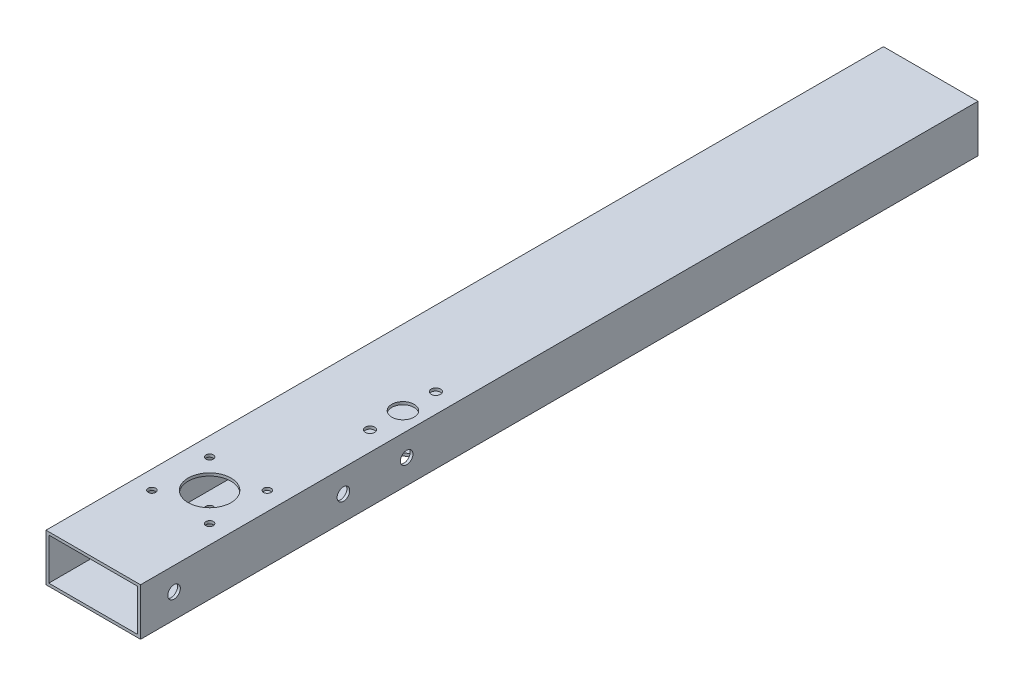
ISO-10303-21;
HEADER;
FILE_DESCRIPTION(('STEP AP214'),'2;1');
FILE_NAME('part.step','',(''),(''),'','','');
FILE_SCHEMA(('AUTOMOTIVE_DESIGN { 1 0 10303 214 1 1 1 1 }'));
ENDSEC;
DATA;
#1=APPLICATION_CONTEXT('core data for automotive mechanical design processes');
#2=APPLICATION_PROTOCOL_DEFINITION('international standard','automotive_design',2000,#1);
#3=PRODUCT_CONTEXT('',#1,'mechanical');
#4=PRODUCT('Part','Part','',(#3));
#5=PRODUCT_RELATED_PRODUCT_CATEGORY('part','',(#4));
#6=PRODUCT_DEFINITION_FORMATION('','',#4);
#7=PRODUCT_DEFINITION_CONTEXT('part definition',#1,'design');
#8=PRODUCT_DEFINITION('design','',#6,#7);
#9=PRODUCT_DEFINITION_SHAPE('','',#8);
#10=(LENGTH_UNIT() NAMED_UNIT(*) SI_UNIT(.MILLI.,.METRE.));
#11=(NAMED_UNIT(*) PLANE_ANGLE_UNIT() SI_UNIT($,.RADIAN.));
#12=(NAMED_UNIT(*) SI_UNIT($,.STERADIAN.) SOLID_ANGLE_UNIT());
#13=UNCERTAINTY_MEASURE_WITH_UNIT(LENGTH_MEASURE(1.E-05),#10,'distance_accuracy_value','');
#14=(GEOMETRIC_REPRESENTATION_CONTEXT(3) GLOBAL_UNCERTAINTY_ASSIGNED_CONTEXT((#13)) GLOBAL_UNIT_ASSIGNED_CONTEXT((#10,
#11,#12)) REPRESENTATION_CONTEXT('',''));
#15=CARTESIAN_POINT('',(0.,0.,0.));
#16=DIRECTION('',(0.,0.,1.));
#17=DIRECTION('',(1.,0.,0.));
#18=AXIS2_PLACEMENT_3D('',#15,#16,#17);
#19=CARTESIAN_POINT('',(-25.4000000000001,-12.7,450.));
#20=DIRECTION('',(1.,0.,0.));
#21=DIRECTION('',(0.,0.,-1.));
#22=AXIS2_PLACEMENT_3D('',#19,#20,#21);
#23=PLANE('',#22);
#24=CARTESIAN_POINT('',(-25.4000000000001,0.400000000001483,432.));
#25=DIRECTION('',(-1.,0.,0.));
#26=DIRECTION('',(0.,0.,1.));
#27=AXIS2_PLACEMENT_3D('',#24,#25,#26);
#28=CIRCLE('',#27,3.37819999999999);
#29=CARTESIAN_POINT('',(-25.4000000000001,0.400000000001483,435.3782));
#30=VERTEX_POINT('',#29);
#31=EDGE_CURVE('E235',#30,#30,#28,.T.);
#32=ORIENTED_EDGE('',*,*,#31,.F.);
#33=EDGE_LOOP('',(#32));
#34=FACE_BOUND('',#33,.T.);
#35=CARTESIAN_POINT('',(-25.4000000000001,0.399999999999345,307.000000000001));
#36=DIRECTION('',(-1.,0.,0.));
#37=DIRECTION('',(0.,0.,1.));
#38=AXIS2_PLACEMENT_3D('',#35,#36,#37);
#39=CIRCLE('',#38,3.37819999999999);
#40=CARTESIAN_POINT('',(-25.4000000000001,0.399999999999345,310.378200000001));
#41=VERTEX_POINT('',#40);
#42=EDGE_CURVE('E242',#41,#41,#39,.T.);
#43=ORIENTED_EDGE('',*,*,#42,.F.);
#44=EDGE_LOOP('',(#43));
#45=FACE_BOUND('',#44,.T.);
#46=DIRECTION('',(0.,-1.,0.));
#47=VECTOR('',#46,1.);
#48=CARTESIAN_POINT('',(-25.4000000000004,-12.7,0.));
#49=LINE('',#48,#47);
#50=CARTESIAN_POINT('',(-25.4000000000001,12.7,0.));
#51=VERTEX_POINT('',#50);
#52=CARTESIAN_POINT('',(-25.4000000000004,-12.7,0.));
#53=VERTEX_POINT('',#52);
#54=EDGE_CURVE('E157',#51,#53,#49,.T.);
#55=ORIENTED_EDGE('',*,*,#54,.T.);
#56=DIRECTION('',(0.,0.,-1.));
#57=VECTOR('',#56,1.);
#58=CARTESIAN_POINT('',(-25.4000000000001,-12.7,450.));
#59=LINE('',#58,#57);
#60=CARTESIAN_POINT('',(-25.4000000000001,-12.7,450.));
#61=VERTEX_POINT('',#60);
#62=EDGE_CURVE('E162',#61,#53,#59,.T.);
#63=ORIENTED_EDGE('',*,*,#62,.F.);
#64=DIRECTION('',(0.,-1.,0.));
#65=VECTOR('',#64,1.);
#66=CARTESIAN_POINT('',(-25.4000000000001,-12.7,450.));
#67=LINE('',#66,#65);
#68=CARTESIAN_POINT('',(-25.4,12.7,450.));
#69=VERTEX_POINT('',#68);
#70=EDGE_CURVE('E148',#69,#61,#67,.T.);
#71=ORIENTED_EDGE('',*,*,#70,.F.);
#72=DIRECTION('',(0.,0.,-1.));
#73=VECTOR('',#72,1.);
#74=CARTESIAN_POINT('',(-25.4,12.7,450.));
#75=LINE('',#74,#73);
#76=EDGE_CURVE('E45',#69,#51,#75,.T.);
#77=ORIENTED_EDGE('',*,*,#76,.T.);
#78=EDGE_LOOP('',(#55,#63,#71,#77));
#79=FACE_BOUND('',#78,.T.);
#80=CARTESIAN_POINT('',(-25.4000000000001,0.399999999997569,340.999999999999));
#81=DIRECTION('',(-1.,0.,0.));
#82=DIRECTION('',(0.,0.,1.));
#83=AXIS2_PLACEMENT_3D('',#80,#81,#82);
#84=CIRCLE('',#83,3.37819999999999);
#85=CARTESIAN_POINT('',(-25.4000000000001,0.399999999997569,344.378199999999));
#86=VERTEX_POINT('',#85);
#87=EDGE_CURVE('E228',#86,#86,#84,.T.);
#88=ORIENTED_EDGE('',*,*,#87,.F.);
#89=EDGE_LOOP('',(#88));
#90=FACE_BOUND('',#89,.T.);
#91=ADVANCED_FACE('F36',(#34,#45,#79,#90),#23,.F.);
#92=CARTESIAN_POINT('',(0.,0.,450.));
#93=DIRECTION('',(0.,0.,-1.));
#94=DIRECTION('',(-1.,0.,0.));
#95=AXIS2_PLACEMENT_3D('',#92,#93,#94);
#96=PLANE('',#95);
#97=DIRECTION('',(0.,1.,0.));
#98=VECTOR('',#97,1.);
#99=CARTESIAN_POINT('',(25.4,-12.7,450.));
#100=LINE('',#99,#98);
#101=CARTESIAN_POINT('',(25.4,-12.7,450.));
#102=VERTEX_POINT('',#101);
#103=CARTESIAN_POINT('',(25.4,12.7,450.));
#104=VERTEX_POINT('',#103);
#105=EDGE_CURVE('E142',#102,#104,#100,.T.);
#106=ORIENTED_EDGE('',*,*,#105,.T.);
#107=DIRECTION('',(-1.,0.,0.));
#108=VECTOR('',#107,1.);
#109=CARTESIAN_POINT('',(-25.4,12.7,450.));
#110=LINE('',#109,#108);
#111=EDGE_CURVE('E145',#104,#69,#110,.T.);
#112=ORIENTED_EDGE('',*,*,#111,.T.);
#113=ORIENTED_EDGE('',*,*,#70,.T.);
#114=DIRECTION('',(1.,0.,0.));
#115=VECTOR('',#114,1.);
#116=CARTESIAN_POINT('',(-25.4000000000001,-12.7,450.));
#117=LINE('',#116,#115);
#118=EDGE_CURVE('E150',#61,#102,#117,.T.);
#119=ORIENTED_EDGE('',*,*,#118,.T.);
#120=EDGE_LOOP('',(#106,#112,#113,#119));
#121=FACE_BOUND('',#120,.T.);
#122=DIRECTION('',(1.,0.,0.));
#123=VECTOR('',#122,1.);
#124=CARTESIAN_POINT('',(-23.9000000000001,-11.2,450.));
#125=LINE('',#124,#123);
#126=CARTESIAN_POINT('',(-23.9000000000001,-11.2,450.));
#127=VERTEX_POINT('',#126);
#128=CARTESIAN_POINT('',(23.8999999999999,-11.2,450.));
#129=VERTEX_POINT('',#128);
#130=EDGE_CURVE('E103',#127,#129,#125,.T.);
#131=ORIENTED_EDGE('',*,*,#130,.F.);
#132=DIRECTION('',(0.,-1.,0.));
#133=VECTOR('',#132,1.);
#134=CARTESIAN_POINT('',(-23.9000000000001,-11.2,450.));
#135=LINE('',#134,#133);
#136=CARTESIAN_POINT('',(-23.9,11.2,450.));
#137=VERTEX_POINT('',#136);
#138=EDGE_CURVE('E126',#137,#127,#135,.T.);
#139=ORIENTED_EDGE('',*,*,#138,.F.);
#140=DIRECTION('',(-1.,0.,0.));
#141=VECTOR('',#140,1.);
#142=CARTESIAN_POINT('',(-23.9,11.2,450.));
#143=LINE('',#142,#141);
#144=CARTESIAN_POINT('',(23.9,11.2,450.));
#145=VERTEX_POINT('',#144);
#146=EDGE_CURVE('E124',#145,#137,#143,.T.);
#147=ORIENTED_EDGE('',*,*,#146,.F.);
#148=DIRECTION('',(0.,1.,0.));
#149=VECTOR('',#148,1.);
#150=CARTESIAN_POINT('',(23.8999999999999,-11.2,450.));
#151=LINE('',#150,#149);
#152=EDGE_CURVE('E111',#129,#145,#151,.T.);
#153=ORIENTED_EDGE('',*,*,#152,.F.);
#154=EDGE_LOOP('',(#131,#139,#147,#153));
#155=FACE_BOUND('',#154,.T.);
#156=ADVANCED_FACE('F123',(#121,#155),#96,.F.);
#157=CARTESIAN_POINT('',(0.,0.,0.));
#158=DIRECTION('',(0.,0.,-1.));
#159=DIRECTION('',(-1.,0.,0.));
#160=AXIS2_PLACEMENT_3D('',#157,#158,#159);
#161=PLANE('',#160);
#162=DIRECTION('',(0.,1.,0.));
#163=VECTOR('',#162,1.);
#164=CARTESIAN_POINT('',(25.3999999999996,-12.7,0.));
#165=LINE('',#164,#163);
#166=CARTESIAN_POINT('',(25.3999999999996,-12.7,0.));
#167=VERTEX_POINT('',#166);
#168=CARTESIAN_POINT('',(25.4,12.7,0.));
#169=VERTEX_POINT('',#168);
#170=EDGE_CURVE('E119',#167,#169,#165,.T.);
#171=ORIENTED_EDGE('',*,*,#170,.F.);
#172=DIRECTION('',(1.,0.,0.));
#173=VECTOR('',#172,1.);
#174=CARTESIAN_POINT('',(-25.4000000000004,-12.7,0.));
#175=LINE('',#174,#173);
#176=EDGE_CURVE('E146',#53,#167,#175,.T.);
#177=ORIENTED_EDGE('',*,*,#176,.F.);
#178=ORIENTED_EDGE('',*,*,#54,.F.);
#179=DIRECTION('',(-1.,0.,0.));
#180=VECTOR('',#179,1.);
#181=CARTESIAN_POINT('',(-25.4000000000001,12.7,0.));
#182=LINE('',#181,#180);
#183=EDGE_CURVE('E155',#169,#51,#182,.T.);
#184=ORIENTED_EDGE('',*,*,#183,.F.);
#185=EDGE_LOOP('',(#171,#177,#178,#184));
#186=FACE_BOUND('',#185,.T.);
#187=DIRECTION('',(0.,-1.,0.));
#188=VECTOR('',#187,1.);
#189=CARTESIAN_POINT('',(-23.9000000000004,-11.2,0.));
#190=LINE('',#189,#188);
#191=CARTESIAN_POINT('',(-23.9,11.2,0.));
#192=VERTEX_POINT('',#191);
#193=CARTESIAN_POINT('',(-23.9000000000004,-11.2,0.));
#194=VERTEX_POINT('',#193);
#195=EDGE_CURVE('E112',#192,#194,#190,.T.);
#196=ORIENTED_EDGE('',*,*,#195,.T.);
#197=DIRECTION('',(1.,0.,0.));
#198=VECTOR('',#197,1.);
#199=CARTESIAN_POINT('',(-23.9000000000004,-11.2,0.));
#200=LINE('',#199,#198);
#201=CARTESIAN_POINT('',(23.8999999999996,-11.2,0.));
#202=VERTEX_POINT('',#201);
#203=EDGE_CURVE('E61',#194,#202,#200,.T.);
#204=ORIENTED_EDGE('',*,*,#203,.T.);
#205=DIRECTION('',(0.,1.,0.));
#206=VECTOR('',#205,1.);
#207=CARTESIAN_POINT('',(23.8999999999996,-11.2,0.));
#208=LINE('',#207,#206);
#209=CARTESIAN_POINT('',(23.8999999999999,11.2,0.));
#210=VERTEX_POINT('',#209);
#211=EDGE_CURVE('E118',#202,#210,#208,.T.);
#212=ORIENTED_EDGE('',*,*,#211,.T.);
#213=DIRECTION('',(-1.,0.,0.));
#214=VECTOR('',#213,1.);
#215=CARTESIAN_POINT('',(-23.9,11.2,0.));
#216=LINE('',#215,#214);
#217=EDGE_CURVE('E134',#210,#192,#216,.T.);
#218=ORIENTED_EDGE('',*,*,#217,.T.);
#219=EDGE_LOOP('',(#196,#204,#212,#218));
#220=FACE_BOUND('',#219,.T.);
#221=ADVANCED_FACE('F308',(#186,#220),#161,.T.);
#222=CARTESIAN_POINT('',(25.4,-12.7,450.));
#223=DIRECTION('',(-1.,0.,0.));
#224=DIRECTION('',(0.,0.,1.));
#225=AXIS2_PLACEMENT_3D('',#222,#223,#224);
#226=PLANE('',#225);
#227=CARTESIAN_POINT('',(25.4,0.399999999997569,340.999999999998));
#228=DIRECTION('',(-1.,0.,0.));
#229=DIRECTION('',(0.,0.,1.));
#230=AXIS2_PLACEMENT_3D('',#227,#228,#229);
#231=CIRCLE('',#230,3.37819999999998);
#232=CARTESIAN_POINT('',(25.4,0.399999999997569,344.378199999998));
#233=VERTEX_POINT('',#232);
#234=EDGE_CURVE('E206',#233,#233,#231,.T.);
#235=ORIENTED_EDGE('',*,*,#234,.T.);
#236=EDGE_LOOP('',(#235));
#237=FACE_BOUND('',#236,.T.);
#238=CARTESIAN_POINT('',(25.4,0.400000000001483,431.999999999999));
#239=DIRECTION('',(-1.,0.,0.));
#240=DIRECTION('',(0.,0.,1.));
#241=AXIS2_PLACEMENT_3D('',#238,#239,#240);
#242=CIRCLE('',#241,3.37819999999998);
#243=CARTESIAN_POINT('',(25.4,0.400000000001483,435.378199999999));
#244=VERTEX_POINT('',#243);
#245=EDGE_CURVE('E201',#244,#244,#242,.T.);
#246=ORIENTED_EDGE('',*,*,#245,.T.);
#247=EDGE_LOOP('',(#246));
#248=FACE_BOUND('',#247,.T.);
#249=CARTESIAN_POINT('',(25.4,0.399999999999345,307.000000000001));
#250=DIRECTION('',(-1.,0.,0.));
#251=DIRECTION('',(0.,0.,1.));
#252=AXIS2_PLACEMENT_3D('',#249,#250,#251);
#253=CIRCLE('',#252,3.37819999999998);
#254=CARTESIAN_POINT('',(25.4,0.399999999999345,310.378200000001));
#255=VERTEX_POINT('',#254);
#256=EDGE_CURVE('E196',#255,#255,#253,.T.);
#257=ORIENTED_EDGE('',*,*,#256,.T.);
#258=EDGE_LOOP('',(#257));
#259=FACE_BOUND('',#258,.T.);
#260=ORIENTED_EDGE('',*,*,#170,.T.);
#261=DIRECTION('',(0.,0.,-1.));
#262=VECTOR('',#261,1.);
#263=CARTESIAN_POINT('',(25.4,12.7,450.));
#264=LINE('',#263,#262);
#265=EDGE_CURVE('E11',#104,#169,#264,.T.);
#266=ORIENTED_EDGE('',*,*,#265,.F.);
#267=ORIENTED_EDGE('',*,*,#105,.F.);
#268=DIRECTION('',(0.,0.,-1.));
#269=VECTOR('',#268,1.);
#270=CARTESIAN_POINT('',(25.4,-12.7,450.));
#271=LINE('',#270,#269);
#272=EDGE_CURVE('E152',#102,#167,#271,.T.);
#273=ORIENTED_EDGE('',*,*,#272,.T.);
#274=EDGE_LOOP('',(#260,#266,#267,#273));
#275=FACE_BOUND('',#274,.T.);
#276=ADVANCED_FACE('F38',(#237,#248,#259,#275),#226,.F.);
#277=CARTESIAN_POINT('',(-25.4,12.7,450.));
#278=DIRECTION('',(0.,-1.,0.));
#279=DIRECTION('',(0.,0.,-1.));
#280=AXIS2_PLACEMENT_3D('',#277,#278,#279);
#281=PLANE('',#280);
#282=CARTESIAN_POINT('',(14.8999999999996,12.7,280.8));
#283=DIRECTION('',(0.,-1.,0.));
#284=DIRECTION('',(0.,0.,-1.));
#285=AXIS2_PLACEMENT_3D('',#282,#283,#284);
#286=CIRCLE('',#285,2.5);
#287=CARTESIAN_POINT('',(14.8999999999996,12.7,278.3));
#288=VERTEX_POINT('',#287);
#289=EDGE_CURVE('E327',#288,#288,#286,.F.);
#290=ORIENTED_EDGE('',*,*,#289,.F.);
#291=EDGE_LOOP('',(#290));
#292=FACE_BOUND('',#291,.T.);
#293=CARTESIAN_POINT('',(14.8999999999999,12.7,316.2));
#294=DIRECTION('',(0.,-1.,0.));
#295=DIRECTION('',(0.,0.,-1.));
#296=AXIS2_PLACEMENT_3D('',#293,#294,#295);
#297=CIRCLE('',#296,2.5);
#298=CARTESIAN_POINT('',(14.8999999999999,12.7,313.7));
#299=VERTEX_POINT('',#298);
#300=EDGE_CURVE('E331',#299,#299,#297,.F.);
#301=ORIENTED_EDGE('',*,*,#300,.F.);
#302=EDGE_LOOP('',(#301));
#303=FACE_BOUND('',#302,.T.);
#304=CARTESIAN_POINT('',(14.9,12.7,298.5));
#305=DIRECTION('',(0.,-1.,0.));
#306=DIRECTION('',(0.,0.,-1.));
#307=AXIS2_PLACEMENT_3D('',#304,#305,#306);
#308=CIRCLE('',#307,6.00000000000001);
#309=CARTESIAN_POINT('',(14.9,12.7,292.5));
#310=VERTEX_POINT('',#309);
#311=EDGE_CURVE('E210',#310,#310,#308,.F.);
#312=ORIENTED_EDGE('',*,*,#311,.F.);
#313=EDGE_LOOP('',(#312));
#314=FACE_BOUND('',#313,.T.);
#315=CARTESIAN_POINT('',(-15.5000000000004,12.7,372.));
#316=DIRECTION('',(0.,-1.,0.));
#317=DIRECTION('',(0.,0.,-1.));
#318=AXIS2_PLACEMENT_3D('',#315,#316,#317);
#319=CIRCLE('',#318,2.);
#320=CARTESIAN_POINT('',(-15.5000000000004,12.7,370.));
#321=VERTEX_POINT('',#320);
#322=EDGE_CURVE('E253',#321,#321,#319,.T.);
#323=ORIENTED_EDGE('',*,*,#322,.T.);
#324=EDGE_LOOP('',(#323));
#325=FACE_BOUND('',#324,.T.);
#326=CARTESIAN_POINT('',(15.4999999999996,12.7,372.));
#327=DIRECTION('',(0.,-1.,0.));
#328=DIRECTION('',(0.,0.,-1.));
#329=AXIS2_PLACEMENT_3D('',#326,#327,#328);
#330=CIRCLE('',#329,2.);
#331=CARTESIAN_POINT('',(15.4999999999996,12.7,370.));
#332=VERTEX_POINT('',#331);
#333=EDGE_CURVE('E260',#332,#332,#330,.T.);
#334=ORIENTED_EDGE('',*,*,#333,.T.);
#335=EDGE_LOOP('',(#334));
#336=FACE_BOUND('',#335,.T.);
#337=CARTESIAN_POINT('',(15.5,12.7,403.));
#338=DIRECTION('',(0.,-1.,0.));
#339=DIRECTION('',(0.,0.,-1.));
#340=AXIS2_PLACEMENT_3D('',#337,#338,#339);
#341=CIRCLE('',#340,2.);
#342=CARTESIAN_POINT('',(15.5,12.7,401.));
#343=VERTEX_POINT('',#342);
#344=EDGE_CURVE('E267',#343,#343,#341,.T.);
#345=ORIENTED_EDGE('',*,*,#344,.T.);
#346=EDGE_LOOP('',(#345));
#347=FACE_BOUND('',#346,.T.);
#348=CARTESIAN_POINT('',(-15.5000000000001,12.7,403.));
#349=DIRECTION('',(0.,-1.,0.));
#350=DIRECTION('',(0.,0.,-1.));
#351=AXIS2_PLACEMENT_3D('',#348,#349,#350);
#352=CIRCLE('',#351,2.);
#353=CARTESIAN_POINT('',(-15.5000000000001,12.7,401.));
#354=VERTEX_POINT('',#353);
#355=EDGE_CURVE('E274',#354,#354,#352,.T.);
#356=ORIENTED_EDGE('',*,*,#355,.T.);
#357=EDGE_LOOP('',(#356));
#358=FACE_BOUND('',#357,.T.);
#359=CARTESIAN_POINT('',(0.,12.7,387.5));
#360=DIRECTION('',(0.,-1.,0.));
#361=DIRECTION('',(0.,0.,-1.));
#362=AXIS2_PLACEMENT_3D('',#359,#360,#361);
#363=CIRCLE('',#362,11.5);
#364=CARTESIAN_POINT('',(0.,12.7,376.));
#365=VERTEX_POINT('',#364);
#366=EDGE_CURVE('E132',#365,#365,#363,.T.);
#367=ORIENTED_EDGE('',*,*,#366,.T.);
#368=EDGE_LOOP('',(#367));
#369=FACE_BOUND('',#368,.T.);
#370=ORIENTED_EDGE('',*,*,#183,.T.);
#371=ORIENTED_EDGE('',*,*,#76,.F.);
#372=ORIENTED_EDGE('',*,*,#111,.F.);
#373=ORIENTED_EDGE('',*,*,#265,.T.);
#374=EDGE_LOOP('',(#370,#371,#372,#373));
#375=FACE_BOUND('',#374,.T.);
#376=ADVANCED_FACE('F283',(#292,#303,#314,#325,#336,#347,#358,#369,#375),#281,.F.);
#377=CARTESIAN_POINT('',(-25.4000000000001,-12.7,450.));
#378=DIRECTION('',(0.,1.,0.));
#379=DIRECTION('',(0.,0.,1.));
#380=AXIS2_PLACEMENT_3D('',#377,#378,#379);
#381=PLANE('',#380);
#382=CARTESIAN_POINT('',(14.8999999999999,-12.7,280.8));
#383=DIRECTION('',(0.,-1.,0.));
#384=DIRECTION('',(0.,0.,-1.));
#385=AXIS2_PLACEMENT_3D('',#382,#383,#384);
#386=CIRCLE('',#385,2.5);
#387=CARTESIAN_POINT('',(14.8999999999999,-12.7,278.3));
#388=VERTEX_POINT('',#387);
#389=EDGE_CURVE('E413',#388,#388,#386,.T.);
#390=ORIENTED_EDGE('',*,*,#389,.F.);
#391=EDGE_LOOP('',(#390));
#392=FACE_BOUND('',#391,.T.);
#393=CARTESIAN_POINT('',(14.8999999999996,-12.7,316.2));
#394=DIRECTION('',(0.,-1.,0.));
#395=DIRECTION('',(0.,0.,-1.));
#396=AXIS2_PLACEMENT_3D('',#393,#394,#395);
#397=CIRCLE('',#396,2.5);
#398=CARTESIAN_POINT('',(14.8999999999996,-12.7,313.7));
#399=VERTEX_POINT('',#398);
#400=EDGE_CURVE('E408',#399,#399,#397,.T.);
#401=ORIENTED_EDGE('',*,*,#400,.F.);
#402=EDGE_LOOP('',(#401));
#403=FACE_BOUND('',#402,.T.);
#404=CARTESIAN_POINT('',(14.9,-12.7,298.5));
#405=DIRECTION('',(0.,-1.,0.));
#406=DIRECTION('',(0.,0.,-1.));
#407=AXIS2_PLACEMENT_3D('',#404,#405,#406);
#408=CIRCLE('',#407,6.00000000000001);
#409=CARTESIAN_POINT('',(14.9,-12.7,292.5));
#410=VERTEX_POINT('',#409);
#411=EDGE_CURVE('E411',#410,#410,#408,.T.);
#412=ORIENTED_EDGE('',*,*,#411,.F.);
#413=EDGE_LOOP('',(#412));
#414=FACE_BOUND('',#413,.T.);
#415=CARTESIAN_POINT('',(-15.5,-12.7,372.));
#416=DIRECTION('',(0.,-1.,0.));
#417=DIRECTION('',(0.,0.,1.));
#418=AXIS2_PLACEMENT_3D('',#415,#416,#417);
#419=CIRCLE('',#418,2.);
#420=CARTESIAN_POINT('',(-15.5,-12.7,374.));
#421=VERTEX_POINT('',#420);
#422=EDGE_CURVE('E191',#421,#421,#419,.T.);
#423=ORIENTED_EDGE('',*,*,#422,.F.);
#424=EDGE_LOOP('',(#423));
#425=FACE_BOUND('',#424,.T.);
#426=CARTESIAN_POINT('',(15.5,-12.7,372.));
#427=DIRECTION('',(0.,-1.,0.));
#428=DIRECTION('',(0.,0.,-1.));
#429=AXIS2_PLACEMENT_3D('',#426,#427,#428);
#430=CIRCLE('',#429,2.);
#431=CARTESIAN_POINT('',(15.5,-12.7,370.));
#432=VERTEX_POINT('',#431);
#433=EDGE_CURVE('E186',#432,#432,#430,.T.);
#434=ORIENTED_EDGE('',*,*,#433,.F.);
#435=EDGE_LOOP('',(#434));
#436=FACE_BOUND('',#435,.T.);
#437=CARTESIAN_POINT('',(15.5,-12.7,403.));
#438=DIRECTION('',(0.,-1.,0.));
#439=DIRECTION('',(0.,0.,1.));
#440=AXIS2_PLACEMENT_3D('',#437,#438,#439);
#441=CIRCLE('',#440,2.);
#442=CARTESIAN_POINT('',(15.5,-12.7,405.));
#443=VERTEX_POINT('',#442);
#444=EDGE_CURVE('E181',#443,#443,#441,.T.);
#445=ORIENTED_EDGE('',*,*,#444,.F.);
#446=EDGE_LOOP('',(#445));
#447=FACE_BOUND('',#446,.T.);
#448=CARTESIAN_POINT('',(-15.5,-12.7,403.));
#449=DIRECTION('',(0.,-1.,0.));
#450=DIRECTION('',(0.,0.,-1.));
#451=AXIS2_PLACEMENT_3D('',#448,#449,#450);
#452=CIRCLE('',#451,2.);
#453=CARTESIAN_POINT('',(-15.5,-12.7,401.));
#454=VERTEX_POINT('',#453);
#455=EDGE_CURVE('E176',#454,#454,#452,.T.);
#456=ORIENTED_EDGE('',*,*,#455,.F.);
#457=EDGE_LOOP('',(#456));
#458=FACE_BOUND('',#457,.T.);
#459=CARTESIAN_POINT('',(0.,-12.7,387.5));
#460=DIRECTION('',(0.,-1.,0.));
#461=DIRECTION('',(0.,0.,-1.));
#462=AXIS2_PLACEMENT_3D('',#459,#460,#461);
#463=CIRCLE('',#462,11.5);
#464=CARTESIAN_POINT('',(0.,-12.7,376.));
#465=VERTEX_POINT('',#464);
#466=EDGE_CURVE('E171',#465,#465,#463,.T.);
#467=ORIENTED_EDGE('',*,*,#466,.F.);
#468=EDGE_LOOP('',(#467));
#469=FACE_BOUND('',#468,.T.);
#470=ORIENTED_EDGE('',*,*,#176,.T.);
#471=ORIENTED_EDGE('',*,*,#272,.F.);
#472=ORIENTED_EDGE('',*,*,#118,.F.);
#473=ORIENTED_EDGE('',*,*,#62,.T.);
#474=EDGE_LOOP('',(#470,#471,#472,#473));
#475=FACE_BOUND('',#474,.T.);
#476=ADVANCED_FACE('F314',(#392,#403,#414,#425,#436,#447,#458,#469,#475),#381,.F.);
#477=CARTESIAN_POINT('',(-23.9000000000001,-11.2,450.));
#478=DIRECTION('',(0.,1.,0.));
#479=DIRECTION('',(0.,0.,1.));
#480=AXIS2_PLACEMENT_3D('',#477,#478,#479);
#481=PLANE('',#480);
#482=CARTESIAN_POINT('',(14.8999999999999,-11.2,280.8));
#483=DIRECTION('',(0.,1.,0.));
#484=DIRECTION('',(0.,0.,1.));
#485=AXIS2_PLACEMENT_3D('',#482,#483,#484);
#486=CIRCLE('',#485,2.5);
#487=CARTESIAN_POINT('',(14.8999999999999,-11.2,283.3));
#488=VERTEX_POINT('',#487);
#489=EDGE_CURVE('E225',#488,#488,#486,.T.);
#490=ORIENTED_EDGE('',*,*,#489,.F.);
#491=EDGE_LOOP('',(#490));
#492=FACE_BOUND('',#491,.T.);
#493=CARTESIAN_POINT('',(14.8999999999996,-11.2,316.2));
#494=DIRECTION('',(0.,1.,0.));
#495=DIRECTION('',(0.,0.,1.));
#496=AXIS2_PLACEMENT_3D('',#493,#494,#495);
#497=CIRCLE('',#496,2.5);
#498=CARTESIAN_POINT('',(14.8999999999996,-11.2,318.7));
#499=VERTEX_POINT('',#498);
#500=EDGE_CURVE('E213',#499,#499,#497,.T.);
#501=ORIENTED_EDGE('',*,*,#500,.F.);
#502=EDGE_LOOP('',(#501));
#503=FACE_BOUND('',#502,.T.);
#504=CARTESIAN_POINT('',(14.9,-11.2,298.5));
#505=DIRECTION('',(0.,1.,0.));
#506=DIRECTION('',(0.,0.,1.));
#507=AXIS2_PLACEMENT_3D('',#504,#505,#506);
#508=CIRCLE('',#507,6.00000000000001);
#509=CARTESIAN_POINT('',(14.9,-11.2,304.5));
#510=VERTEX_POINT('',#509);
#511=EDGE_CURVE('E209',#510,#510,#508,.T.);
#512=ORIENTED_EDGE('',*,*,#511,.F.);
#513=EDGE_LOOP('',(#512));
#514=FACE_BOUND('',#513,.T.);
#515=CARTESIAN_POINT('',(-15.5,-11.2,372.));
#516=DIRECTION('',(0.,1.,0.));
#517=DIRECTION('',(0.,0.,1.));
#518=AXIS2_PLACEMENT_3D('',#515,#516,#517);
#519=CIRCLE('',#518,2.);
#520=CARTESIAN_POINT('',(-15.5,-11.2,374.));
#521=VERTEX_POINT('',#520);
#522=EDGE_CURVE('E190',#521,#521,#519,.T.);
#523=ORIENTED_EDGE('',*,*,#522,.F.);
#524=EDGE_LOOP('',(#523));
#525=FACE_BOUND('',#524,.T.);
#526=CARTESIAN_POINT('',(15.5,-11.2,372.));
#527=DIRECTION('',(0.,1.,0.));
#528=DIRECTION('',(0.,0.,1.));
#529=AXIS2_PLACEMENT_3D('',#526,#527,#528);
#530=CIRCLE('',#529,2.);
#531=CARTESIAN_POINT('',(15.5,-11.2,374.));
#532=VERTEX_POINT('',#531);
#533=EDGE_CURVE('E185',#532,#532,#530,.T.);
#534=ORIENTED_EDGE('',*,*,#533,.F.);
#535=EDGE_LOOP('',(#534));
#536=FACE_BOUND('',#535,.T.);
#537=CARTESIAN_POINT('',(15.5,-11.2,403.));
#538=DIRECTION('',(0.,1.,0.));
#539=DIRECTION('',(0.,0.,1.));
#540=AXIS2_PLACEMENT_3D('',#537,#538,#539);
#541=CIRCLE('',#540,2.);
#542=CARTESIAN_POINT('',(15.5,-11.2,405.));
#543=VERTEX_POINT('',#542);
#544=EDGE_CURVE('E180',#543,#543,#541,.T.);
#545=ORIENTED_EDGE('',*,*,#544,.F.);
#546=EDGE_LOOP('',(#545));
#547=FACE_BOUND('',#546,.T.);
#548=CARTESIAN_POINT('',(-15.5,-11.2,403.));
#549=DIRECTION('',(0.,1.,0.));
#550=DIRECTION('',(0.,0.,1.));
#551=AXIS2_PLACEMENT_3D('',#548,#549,#550);
#552=CIRCLE('',#551,2.);
#553=CARTESIAN_POINT('',(-15.5,-11.2,405.));
#554=VERTEX_POINT('',#553);
#555=EDGE_CURVE('E175',#554,#554,#552,.T.);
#556=ORIENTED_EDGE('',*,*,#555,.F.);
#557=EDGE_LOOP('',(#556));
#558=FACE_BOUND('',#557,.T.);
#559=CARTESIAN_POINT('',(0.,-11.2,387.5));
#560=DIRECTION('',(0.,1.,0.));
#561=DIRECTION('',(0.,0.,1.));
#562=AXIS2_PLACEMENT_3D('',#559,#560,#561);
#563=CIRCLE('',#562,11.5);
#564=CARTESIAN_POINT('',(0.,-11.2,399.));
#565=VERTEX_POINT('',#564);
#566=EDGE_CURVE('E170',#565,#565,#563,.T.);
#567=ORIENTED_EDGE('',*,*,#566,.F.);
#568=EDGE_LOOP('',(#567));
#569=FACE_BOUND('',#568,.T.);
#570=ORIENTED_EDGE('',*,*,#203,.F.);
#571=DIRECTION('',(0.,0.,-1.));
#572=VECTOR('',#571,1.);
#573=CARTESIAN_POINT('',(-23.9000000000001,-11.2,450.));
#574=LINE('',#573,#572);
#575=EDGE_CURVE('E107',#127,#194,#574,.T.);
#576=ORIENTED_EDGE('',*,*,#575,.F.);
#577=ORIENTED_EDGE('',*,*,#130,.T.);
#578=DIRECTION('',(0.,0.,-1.));
#579=VECTOR('',#578,1.);
#580=CARTESIAN_POINT('',(23.8999999999999,-11.2,450.));
#581=LINE('',#580,#579);
#582=EDGE_CURVE('E106',#129,#202,#581,.T.);
#583=ORIENTED_EDGE('',*,*,#582,.T.);
#584=EDGE_LOOP('',(#570,#576,#577,#583));
#585=FACE_BOUND('',#584,.T.);
#586=ADVANCED_FACE('F105',(#492,#503,#514,#525,#536,#547,#558,#569,#585),#481,.T.);
#587=CARTESIAN_POINT('',(23.8999999999999,-11.2,450.));
#588=DIRECTION('',(-1.,0.,0.));
#589=DIRECTION('',(0.,0.,1.));
#590=AXIS2_PLACEMENT_3D('',#587,#588,#589);
#591=PLANE('',#590);
#592=CARTESIAN_POINT('',(23.8999999999999,0.399999999997569,340.999999999999));
#593=DIRECTION('',(-1.,0.,0.));
#594=DIRECTION('',(0.,0.,1.));
#595=AXIS2_PLACEMENT_3D('',#592,#593,#594);
#596=CIRCLE('',#595,3.37819999999998);
#597=CARTESIAN_POINT('',(23.8999999999999,0.399999999997569,344.378199999999));
#598=VERTEX_POINT('',#597);
#599=EDGE_CURVE('E205',#598,#598,#596,.T.);
#600=ORIENTED_EDGE('',*,*,#599,.F.);
#601=EDGE_LOOP('',(#600));
#602=FACE_BOUND('',#601,.T.);
#603=CARTESIAN_POINT('',(23.8999999999999,0.400000000001483,432.));
#604=DIRECTION('',(-1.,0.,0.));
#605=DIRECTION('',(0.,0.,1.));
#606=AXIS2_PLACEMENT_3D('',#603,#604,#605);
#607=CIRCLE('',#606,3.37819999999998);
#608=CARTESIAN_POINT('',(23.8999999999999,0.400000000001483,435.3782));
#609=VERTEX_POINT('',#608);
#610=EDGE_CURVE('E200',#609,#609,#607,.T.);
#611=ORIENTED_EDGE('',*,*,#610,.F.);
#612=EDGE_LOOP('',(#611));
#613=FACE_BOUND('',#612,.T.);
#614=CARTESIAN_POINT('',(23.8999999999999,0.399999999999345,307.000000000001));
#615=DIRECTION('',(-1.,0.,0.));
#616=DIRECTION('',(0.,0.,1.));
#617=AXIS2_PLACEMENT_3D('',#614,#615,#616);
#618=CIRCLE('',#617,3.37819999999998);
#619=CARTESIAN_POINT('',(23.8999999999999,0.399999999999345,310.378200000001));
#620=VERTEX_POINT('',#619);
#621=EDGE_CURVE('E195',#620,#620,#618,.T.);
#622=ORIENTED_EDGE('',*,*,#621,.F.);
#623=EDGE_LOOP('',(#622));
#624=FACE_BOUND('',#623,.T.);
#625=ORIENTED_EDGE('',*,*,#211,.F.);
#626=ORIENTED_EDGE('',*,*,#582,.F.);
#627=ORIENTED_EDGE('',*,*,#152,.T.);
#628=DIRECTION('',(0.,0.,-1.));
#629=VECTOR('',#628,1.);
#630=CARTESIAN_POINT('',(23.9,11.2,450.));
#631=LINE('',#630,#629);
#632=EDGE_CURVE('E120',#145,#210,#631,.T.);
#633=ORIENTED_EDGE('',*,*,#632,.T.);
#634=EDGE_LOOP('',(#625,#626,#627,#633));
#635=FACE_BOUND('',#634,.T.);
#636=ADVANCED_FACE('F115',(#602,#613,#624,#635),#591,.T.);
#637=CARTESIAN_POINT('',(-23.9,11.2,450.));
#638=DIRECTION('',(0.,-1.,0.));
#639=DIRECTION('',(1.,0.,0.));
#640=AXIS2_PLACEMENT_3D('',#637,#638,#639);
#641=PLANE('',#640);
#642=CARTESIAN_POINT('',(14.8999999999996,11.2,280.8));
#643=DIRECTION('',(0.,-1.,0.));
#644=DIRECTION('',(1.,0.,0.));
#645=AXIS2_PLACEMENT_3D('',#642,#643,#644);
#646=CIRCLE('',#645,2.5);
#647=CARTESIAN_POINT('',(17.3999999999996,11.2,280.8));
#648=VERTEX_POINT('',#647);
#649=EDGE_CURVE('E40',#648,#648,#646,.T.);
#650=ORIENTED_EDGE('',*,*,#649,.F.);
#651=EDGE_LOOP('',(#650));
#652=FACE_BOUND('',#651,.T.);
#653=CARTESIAN_POINT('',(14.8999999999999,11.2,316.2));
#654=DIRECTION('',(0.,-1.,0.));
#655=DIRECTION('',(1.,0.,0.));
#656=AXIS2_PLACEMENT_3D('',#653,#654,#655);
#657=CIRCLE('',#656,2.5);
#658=CARTESIAN_POINT('',(17.3999999999999,11.2,316.2));
#659=VERTEX_POINT('',#658);
#660=EDGE_CURVE('E211',#659,#659,#657,.T.);
#661=ORIENTED_EDGE('',*,*,#660,.F.);
#662=EDGE_LOOP('',(#661));
#663=FACE_BOUND('',#662,.T.);
#664=CARTESIAN_POINT('',(14.9,11.2,298.5));
#665=DIRECTION('',(0.,-1.,0.));
#666=DIRECTION('',(1.,0.,0.));
#667=AXIS2_PLACEMENT_3D('',#664,#665,#666);
#668=CIRCLE('',#667,6.00000000000001);
#669=CARTESIAN_POINT('',(20.9,11.2,298.5));
#670=VERTEX_POINT('',#669);
#671=EDGE_CURVE('E207',#670,#670,#668,.T.);
#672=ORIENTED_EDGE('',*,*,#671,.F.);
#673=EDGE_LOOP('',(#672));
#674=FACE_BOUND('',#673,.T.);
#675=CARTESIAN_POINT('',(-15.5000000000004,11.2,372.));
#676=DIRECTION('',(0.,-1.,0.));
#677=DIRECTION('',(1.,0.,0.));
#678=AXIS2_PLACEMENT_3D('',#675,#676,#677);
#679=CIRCLE('',#678,2.);
#680=CARTESIAN_POINT('',(-13.5000000000004,11.2,372.));
#681=VERTEX_POINT('',#680);
#682=EDGE_CURVE('E187',#681,#681,#679,.T.);
#683=ORIENTED_EDGE('',*,*,#682,.F.);
#684=EDGE_LOOP('',(#683));
#685=FACE_BOUND('',#684,.T.);
#686=CARTESIAN_POINT('',(15.4999999999996,11.2,372.));
#687=DIRECTION('',(0.,-1.,0.));
#688=DIRECTION('',(1.,0.,0.));
#689=AXIS2_PLACEMENT_3D('',#686,#687,#688);
#690=CIRCLE('',#689,2.);
#691=CARTESIAN_POINT('',(17.4999999999996,11.2,372.));
#692=VERTEX_POINT('',#691);
#693=EDGE_CURVE('E182',#692,#692,#690,.T.);
#694=ORIENTED_EDGE('',*,*,#693,.F.);
#695=EDGE_LOOP('',(#694));
#696=FACE_BOUND('',#695,.T.);
#697=CARTESIAN_POINT('',(15.4999999999996,11.2,403.));
#698=DIRECTION('',(0.,-1.,0.));
#699=DIRECTION('',(1.,0.,0.));
#700=AXIS2_PLACEMENT_3D('',#697,#698,#699);
#701=CIRCLE('',#700,2.);
#702=CARTESIAN_POINT('',(17.4999999999996,11.2,403.));
#703=VERTEX_POINT('',#702);
#704=EDGE_CURVE('E177',#703,#703,#701,.T.);
#705=ORIENTED_EDGE('',*,*,#704,.F.);
#706=EDGE_LOOP('',(#705));
#707=FACE_BOUND('',#706,.T.);
#708=CARTESIAN_POINT('',(-15.5000000000004,11.2,403.));
#709=DIRECTION('',(0.,-1.,0.));
#710=DIRECTION('',(1.,0.,0.));
#711=AXIS2_PLACEMENT_3D('',#708,#709,#710);
#712=CIRCLE('',#711,2.);
#713=CARTESIAN_POINT('',(-13.5000000000004,11.2,403.));
#714=VERTEX_POINT('',#713);
#715=EDGE_CURVE('E172',#714,#714,#712,.T.);
#716=ORIENTED_EDGE('',*,*,#715,.F.);
#717=EDGE_LOOP('',(#716));
#718=FACE_BOUND('',#717,.T.);
#719=CARTESIAN_POINT('',(0.,11.2,387.5));
#720=DIRECTION('',(0.,-1.,0.));
#721=DIRECTION('',(1.,0.,0.));
#722=AXIS2_PLACEMENT_3D('',#719,#720,#721);
#723=CIRCLE('',#722,11.5);
#724=CARTESIAN_POINT('',(11.5,11.2,387.5));
#725=VERTEX_POINT('',#724);
#726=EDGE_CURVE('E167',#725,#725,#723,.T.);
#727=ORIENTED_EDGE('',*,*,#726,.F.);
#728=EDGE_LOOP('',(#727));
#729=FACE_BOUND('',#728,.T.);
#730=ORIENTED_EDGE('',*,*,#217,.F.);
#731=ORIENTED_EDGE('',*,*,#632,.F.);
#732=ORIENTED_EDGE('',*,*,#146,.T.);
#733=DIRECTION('',(0.,0.,-1.));
#734=VECTOR('',#733,1.);
#735=CARTESIAN_POINT('',(-23.9,11.2,450.));
#736=LINE('',#735,#734);
#737=EDGE_CURVE('E53',#137,#192,#736,.T.);
#738=ORIENTED_EDGE('',*,*,#737,.T.);
#739=EDGE_LOOP('',(#730,#731,#732,#738));
#740=FACE_BOUND('',#739,.T.);
#741=ADVANCED_FACE('F298',(#652,#663,#674,#685,#696,#707,#718,#729,#740),#641,.T.);
#742=CARTESIAN_POINT('',(-23.9000000000001,-11.2,450.));
#743=DIRECTION('',(1.,0.,0.));
#744=DIRECTION('',(0.,0.,-1.));
#745=AXIS2_PLACEMENT_3D('',#742,#743,#744);
#746=PLANE('',#745);
#747=CARTESIAN_POINT('',(-23.9,0.399999999997569,340.999999999999));
#748=DIRECTION('',(1.,0.,0.));
#749=DIRECTION('',(0.,0.,-1.));
#750=AXIS2_PLACEMENT_3D('',#747,#748,#749);
#751=CIRCLE('',#750,3.37819999999998);
#752=CARTESIAN_POINT('',(-23.9,0.399999999997569,337.621799999999));
#753=VERTEX_POINT('',#752);
#754=EDGE_CURVE('E202',#753,#753,#751,.T.);
#755=ORIENTED_EDGE('',*,*,#754,.F.);
#756=EDGE_LOOP('',(#755));
#757=FACE_BOUND('',#756,.T.);
#758=CARTESIAN_POINT('',(-23.9,0.400000000001483,432.));
#759=DIRECTION('',(1.,0.,0.));
#760=DIRECTION('',(0.,0.,-1.));
#761=AXIS2_PLACEMENT_3D('',#758,#759,#760);
#762=CIRCLE('',#761,3.37819999999998);
#763=CARTESIAN_POINT('',(-23.9,0.400000000001483,428.6218));
#764=VERTEX_POINT('',#763);
#765=EDGE_CURVE('E197',#764,#764,#762,.T.);
#766=ORIENTED_EDGE('',*,*,#765,.F.);
#767=EDGE_LOOP('',(#766));
#768=FACE_BOUND('',#767,.T.);
#769=CARTESIAN_POINT('',(-23.9,0.399999999999345,307.000000000001));
#770=DIRECTION('',(1.,0.,0.));
#771=DIRECTION('',(0.,0.,-1.));
#772=AXIS2_PLACEMENT_3D('',#769,#770,#771);
#773=CIRCLE('',#772,3.37819999999998);
#774=CARTESIAN_POINT('',(-23.9,0.399999999999345,303.621800000001));
#775=VERTEX_POINT('',#774);
#776=EDGE_CURVE('E192',#775,#775,#773,.T.);
#777=ORIENTED_EDGE('',*,*,#776,.F.);
#778=EDGE_LOOP('',(#777));
#779=FACE_BOUND('',#778,.T.);
#780=ORIENTED_EDGE('',*,*,#195,.F.);
#781=ORIENTED_EDGE('',*,*,#737,.F.);
#782=ORIENTED_EDGE('',*,*,#138,.T.);
#783=ORIENTED_EDGE('',*,*,#575,.T.);
#784=EDGE_LOOP('',(#780,#781,#782,#783));
#785=FACE_BOUND('',#784,.T.);
#786=ADVANCED_FACE('F289',(#757,#768,#779,#785),#746,.T.);
#787=CARTESIAN_POINT('',(0.,13.3,387.5));
#788=DIRECTION('',(0.,-1.,0.));
#789=DIRECTION('',(0.,0.,-1.));
#790=AXIS2_PLACEMENT_3D('',#787,#788,#789);
#791=CYLINDRICAL_SURFACE('',#790,11.5);
#792=ORIENTED_EDGE('',*,*,#726,.T.);
#793=EDGE_LOOP('',(#792));
#794=FACE_BOUND('',#793,.T.);
#795=ORIENTED_EDGE('',*,*,#366,.F.);
#796=EDGE_LOOP('',(#795));
#797=FACE_BOUND('',#796,.T.);
#798=ADVANCED_FACE('F286',(#794,#797),#791,.F.);
#799=ORIENTED_EDGE('',*,*,#566,.T.);
#800=EDGE_LOOP('',(#799));
#801=FACE_BOUND('',#800,.T.);
#802=ORIENTED_EDGE('',*,*,#466,.T.);
#803=EDGE_LOOP('',(#802));
#804=FACE_BOUND('',#803,.T.);
#805=ADVANCED_FACE('F288',(#801,#804),#791,.F.);
#806=CARTESIAN_POINT('',(-15.5000000000001,13.3,403.));
#807=DIRECTION('',(0.,-1.,0.));
#808=DIRECTION('',(0.,0.,-1.));
#809=AXIS2_PLACEMENT_3D('',#806,#807,#808);
#810=CYLINDRICAL_SURFACE('',#809,2.);
#811=ORIENTED_EDGE('',*,*,#715,.T.);
#812=EDGE_LOOP('',(#811));
#813=FACE_BOUND('',#812,.T.);
#814=ORIENTED_EDGE('',*,*,#355,.F.);
#815=EDGE_LOOP('',(#814));
#816=FACE_BOUND('',#815,.T.);
#817=ADVANCED_FACE('F296',(#813,#816),#810,.F.);
#818=ORIENTED_EDGE('',*,*,#555,.T.);
#819=EDGE_LOOP('',(#818));
#820=FACE_BOUND('',#819,.T.);
#821=ORIENTED_EDGE('',*,*,#455,.T.);
#822=EDGE_LOOP('',(#821));
#823=FACE_BOUND('',#822,.T.);
#824=ADVANCED_FACE('F344',(#820,#823),#810,.F.);
#825=CARTESIAN_POINT('',(15.5,13.3,403.));
#826=DIRECTION('',(0.,-1.,0.));
#827=DIRECTION('',(0.,0.,-1.));
#828=AXIS2_PLACEMENT_3D('',#825,#826,#827);
#829=CYLINDRICAL_SURFACE('',#828,2.);
#830=ORIENTED_EDGE('',*,*,#704,.T.);
#831=EDGE_LOOP('',(#830));
#832=FACE_BOUND('',#831,.T.);
#833=ORIENTED_EDGE('',*,*,#344,.F.);
#834=EDGE_LOOP('',(#833));
#835=FACE_BOUND('',#834,.T.);
#836=ADVANCED_FACE('F349',(#832,#835),#829,.F.);
#837=ORIENTED_EDGE('',*,*,#544,.T.);
#838=EDGE_LOOP('',(#837));
#839=FACE_BOUND('',#838,.T.);
#840=ORIENTED_EDGE('',*,*,#444,.T.);
#841=EDGE_LOOP('',(#840));
#842=FACE_BOUND('',#841,.T.);
#843=ADVANCED_FACE('F354',(#839,#842),#829,.F.);
#844=CARTESIAN_POINT('',(15.4999999999996,13.3,372.));
#845=DIRECTION('',(0.,-1.,0.));
#846=DIRECTION('',(0.,0.,-1.));
#847=AXIS2_PLACEMENT_3D('',#844,#845,#846);
#848=CYLINDRICAL_SURFACE('',#847,2.);
#849=ORIENTED_EDGE('',*,*,#693,.T.);
#850=EDGE_LOOP('',(#849));
#851=FACE_BOUND('',#850,.T.);
#852=ORIENTED_EDGE('',*,*,#333,.F.);
#853=EDGE_LOOP('',(#852));
#854=FACE_BOUND('',#853,.T.);
#855=ADVANCED_FACE('F356',(#851,#854),#848,.F.);
#856=ORIENTED_EDGE('',*,*,#533,.T.);
#857=EDGE_LOOP('',(#856));
#858=FACE_BOUND('',#857,.T.);
#859=ORIENTED_EDGE('',*,*,#433,.T.);
#860=EDGE_LOOP('',(#859));
#861=FACE_BOUND('',#860,.T.);
#862=ADVANCED_FACE('F359',(#858,#861),#848,.F.);
#863=CARTESIAN_POINT('',(-15.5000000000004,13.3,372.));
#864=DIRECTION('',(0.,-1.,0.));
#865=DIRECTION('',(0.,0.,-1.));
#866=AXIS2_PLACEMENT_3D('',#863,#864,#865);
#867=CYLINDRICAL_SURFACE('',#866,2.);
#868=ORIENTED_EDGE('',*,*,#682,.T.);
#869=EDGE_LOOP('',(#868));
#870=FACE_BOUND('',#869,.T.);
#871=ORIENTED_EDGE('',*,*,#322,.F.);
#872=EDGE_LOOP('',(#871));
#873=FACE_BOUND('',#872,.T.);
#874=ADVANCED_FACE('F361',(#870,#873),#867,.F.);
#875=ORIENTED_EDGE('',*,*,#522,.T.);
#876=EDGE_LOOP('',(#875));
#877=FACE_BOUND('',#876,.T.);
#878=ORIENTED_EDGE('',*,*,#422,.T.);
#879=EDGE_LOOP('',(#878));
#880=FACE_BOUND('',#879,.T.);
#881=ADVANCED_FACE('F364',(#877,#880),#867,.F.);
#882=CARTESIAN_POINT('',(-25.4000000000001,0.399999999999345,307.000000000001));
#883=DIRECTION('',(-1.,0.,0.));
#884=DIRECTION('',(0.,0.,1.));
#885=AXIS2_PLACEMENT_3D('',#882,#883,#884);
#886=CYLINDRICAL_SURFACE('',#885,3.37819999999998);
#887=ORIENTED_EDGE('',*,*,#776,.T.);
#888=EDGE_LOOP('',(#887));
#889=FACE_BOUND('',#888,.T.);
#890=ORIENTED_EDGE('',*,*,#42,.T.);
#891=EDGE_LOOP('',(#890));
#892=FACE_BOUND('',#891,.T.);
#893=ADVANCED_FACE('F366',(#889,#892),#886,.F.);
#894=ORIENTED_EDGE('',*,*,#621,.T.);
#895=EDGE_LOOP('',(#894));
#896=FACE_BOUND('',#895,.T.);
#897=ORIENTED_EDGE('',*,*,#256,.F.);
#898=EDGE_LOOP('',(#897));
#899=FACE_BOUND('',#898,.T.);
#900=ADVANCED_FACE('F369',(#896,#899),#886,.F.);
#901=CARTESIAN_POINT('',(-25.4000000000001,0.400000000001483,432.));
#902=DIRECTION('',(-1.,0.,0.));
#903=DIRECTION('',(0.,0.,1.));
#904=AXIS2_PLACEMENT_3D('',#901,#902,#903);
#905=CYLINDRICAL_SURFACE('',#904,3.37819999999998);
#906=ORIENTED_EDGE('',*,*,#765,.T.);
#907=EDGE_LOOP('',(#906));
#908=FACE_BOUND('',#907,.T.);
#909=ORIENTED_EDGE('',*,*,#31,.T.);
#910=EDGE_LOOP('',(#909));
#911=FACE_BOUND('',#910,.T.);
#912=ADVANCED_FACE('F371',(#908,#911),#905,.F.);
#913=ORIENTED_EDGE('',*,*,#610,.T.);
#914=EDGE_LOOP('',(#913));
#915=FACE_BOUND('',#914,.T.);
#916=ORIENTED_EDGE('',*,*,#245,.F.);
#917=EDGE_LOOP('',(#916));
#918=FACE_BOUND('',#917,.T.);
#919=ADVANCED_FACE('F374',(#915,#918),#905,.F.);
#920=CARTESIAN_POINT('',(-25.4000000000001,0.399999999997569,340.999999999999));
#921=DIRECTION('',(-1.,0.,0.));
#922=DIRECTION('',(0.,0.,1.));
#923=AXIS2_PLACEMENT_3D('',#920,#921,#922);
#924=CYLINDRICAL_SURFACE('',#923,3.37819999999998);
#925=ORIENTED_EDGE('',*,*,#754,.T.);
#926=EDGE_LOOP('',(#925));
#927=FACE_BOUND('',#926,.T.);
#928=ORIENTED_EDGE('',*,*,#87,.T.);
#929=EDGE_LOOP('',(#928));
#930=FACE_BOUND('',#929,.T.);
#931=ADVANCED_FACE('F376',(#927,#930),#924,.F.);
#932=ORIENTED_EDGE('',*,*,#599,.T.);
#933=EDGE_LOOP('',(#932));
#934=FACE_BOUND('',#933,.T.);
#935=ORIENTED_EDGE('',*,*,#234,.F.);
#936=EDGE_LOOP('',(#935));
#937=FACE_BOUND('',#936,.T.);
#938=ADVANCED_FACE('F379',(#934,#937),#924,.F.);
#939=CARTESIAN_POINT('',(14.8999999999996,29.6705627484772,298.5));
#940=DIRECTION('',(0.,-1.,0.));
#941=DIRECTION('',(0.,0.,-1.));
#942=AXIS2_PLACEMENT_3D('',#939,#940,#941);
#943=CYLINDRICAL_SURFACE('',#942,6.00000000000001);
#944=ORIENTED_EDGE('',*,*,#671,.T.);
#945=EDGE_LOOP('',(#944));
#946=FACE_BOUND('',#945,.T.);
#947=ORIENTED_EDGE('',*,*,#311,.T.);
#948=EDGE_LOOP('',(#947));
#949=FACE_BOUND('',#948,.T.);
#950=ADVANCED_FACE('F381',(#946,#949),#943,.F.);
#951=CARTESIAN_POINT('',(14.9,29.6705627484772,316.2));
#952=DIRECTION('',(0.,-1.,0.));
#953=DIRECTION('',(0.,0.,-1.));
#954=AXIS2_PLACEMENT_3D('',#951,#952,#953);
#955=CYLINDRICAL_SURFACE('',#954,2.5);
#956=ORIENTED_EDGE('',*,*,#660,.T.);
#957=EDGE_LOOP('',(#956));
#958=FACE_BOUND('',#957,.T.);
#959=ORIENTED_EDGE('',*,*,#300,.T.);
#960=EDGE_LOOP('',(#959));
#961=FACE_BOUND('',#960,.T.);
#962=ADVANCED_FACE('F384',(#958,#961),#955,.F.);
#963=CARTESIAN_POINT('',(14.9,29.6705627484772,280.8));
#964=DIRECTION('',(0.,-1.,0.));
#965=DIRECTION('',(0.,0.,-1.));
#966=AXIS2_PLACEMENT_3D('',#963,#964,#965);
#967=CYLINDRICAL_SURFACE('',#966,2.5);
#968=ORIENTED_EDGE('',*,*,#649,.T.);
#969=EDGE_LOOP('',(#968));
#970=FACE_BOUND('',#969,.T.);
#971=ORIENTED_EDGE('',*,*,#289,.T.);
#972=EDGE_LOOP('',(#971));
#973=FACE_BOUND('',#972,.T.);
#974=ADVANCED_FACE('F387',(#970,#973),#967,.F.);
#975=ORIENTED_EDGE('',*,*,#511,.T.);
#976=EDGE_LOOP('',(#975));
#977=FACE_BOUND('',#976,.T.);
#978=ORIENTED_EDGE('',*,*,#411,.T.);
#979=EDGE_LOOP('',(#978));
#980=FACE_BOUND('',#979,.T.);
#981=ADVANCED_FACE('F386',(#977,#980),#943,.F.);
#982=ORIENTED_EDGE('',*,*,#500,.T.);
#983=EDGE_LOOP('',(#982));
#984=FACE_BOUND('',#983,.T.);
#985=ORIENTED_EDGE('',*,*,#400,.T.);
#986=EDGE_LOOP('',(#985));
#987=FACE_BOUND('',#986,.T.);
#988=ADVANCED_FACE('F393',(#984,#987),#955,.F.);
#989=ORIENTED_EDGE('',*,*,#489,.T.);
#990=EDGE_LOOP('',(#989));
#991=FACE_BOUND('',#990,.T.);
#992=ORIENTED_EDGE('',*,*,#389,.T.);
#993=EDGE_LOOP('',(#992));
#994=FACE_BOUND('',#993,.T.);
#995=ADVANCED_FACE('F391',(#991,#994),#967,.F.);
#996=CLOSED_SHELL('',(#91,#156,#221,#276,#376,#476,#586,#636,#741,#786,#798,#805,#817,#824,#836,
#843,#855,#862,#874,#881,#893,#900,#912,#919,#931,#938,#950,#962,#974,#981,#988,#995));
#997=MANIFOLD_SOLID_BREP('B2',#996);
#998=ADVANCED_BREP_SHAPE_REPRESENTATION('',(#18,#997),#14);
#999=SHAPE_DEFINITION_REPRESENTATION(#9,#998);
ENDSEC;
END-ISO-10303-21;
